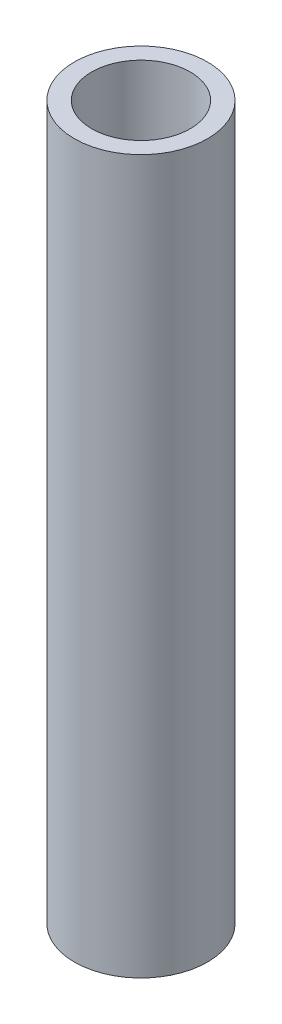
ISO-10303-21;
HEADER;
FILE_DESCRIPTION(('STEP AP214'),'2;1');
FILE_NAME('part.step','',(''),(''),'','','');
FILE_SCHEMA(('AUTOMOTIVE_DESIGN { 1 0 10303 214 1 1 1 1 }'));
ENDSEC;
DATA;
#1=APPLICATION_CONTEXT('core data for automotive mechanical design processes');
#2=APPLICATION_PROTOCOL_DEFINITION('international standard','automotive_design',2000,#1);
#3=PRODUCT_CONTEXT('',#1,'mechanical');
#4=PRODUCT('Part','Part','',(#3));
#5=PRODUCT_RELATED_PRODUCT_CATEGORY('part','',(#4));
#6=PRODUCT_DEFINITION_FORMATION('','',#4);
#7=PRODUCT_DEFINITION_CONTEXT('part definition',#1,'design');
#8=PRODUCT_DEFINITION('design','',#6,#7);
#9=PRODUCT_DEFINITION_SHAPE('','',#8);
#10=(LENGTH_UNIT() NAMED_UNIT(*) SI_UNIT(.MILLI.,.METRE.));
#11=(NAMED_UNIT(*) PLANE_ANGLE_UNIT() SI_UNIT($,.RADIAN.));
#12=(NAMED_UNIT(*) SI_UNIT($,.STERADIAN.) SOLID_ANGLE_UNIT());
#13=UNCERTAINTY_MEASURE_WITH_UNIT(LENGTH_MEASURE(1.E-05),#10,'distance_accuracy_value','');
#14=(GEOMETRIC_REPRESENTATION_CONTEXT(3) GLOBAL_UNCERTAINTY_ASSIGNED_CONTEXT((#13)) GLOBAL_UNIT_ASSIGNED_CONTEXT((#10,
#11,#12)) REPRESENTATION_CONTEXT('',''));
#15=CARTESIAN_POINT('',(0.,0.,0.));
#16=DIRECTION('',(0.,0.,1.));
#17=DIRECTION('',(1.,0.,0.));
#18=AXIS2_PLACEMENT_3D('',#15,#16,#17);
#19=CARTESIAN_POINT('',(0.,114.3,0.));
#20=DIRECTION('',(0.,1.,0.));
#21=DIRECTION('',(0.,0.,1.));
#22=AXIS2_PLACEMENT_3D('',#19,#20,#21);
#23=PLANE('',#22);
#24=CARTESIAN_POINT('',(0.,114.3,0.));
#25=DIRECTION('',(0.,1.,0.));
#26=DIRECTION('',(0.,0.,1.));
#27=AXIS2_PLACEMENT_3D('',#24,#25,#26);
#28=CIRCLE('',#27,10.668);
#29=CARTESIAN_POINT('',(0.,114.3,10.668));
#30=VERTEX_POINT('',#29);
#31=EDGE_CURVE('E10',#30,#30,#28,.T.);
#32=ORIENTED_EDGE('',*,*,#31,.T.);
#33=EDGE_LOOP('',(#32));
#34=FACE_BOUND('',#33,.T.);
#35=CARTESIAN_POINT('',(0.,114.3,0.));
#36=DIRECTION('',(0.,1.,0.));
#37=DIRECTION('',(0.,0.,1.));
#38=AXIS2_PLACEMENT_3D('',#35,#36,#37);
#39=CIRCLE('',#38,7.8994);
#40=CARTESIAN_POINT('',(0.,114.3,7.8994));
#41=VERTEX_POINT('',#40);
#42=EDGE_CURVE('E44',#41,#41,#39,.T.);
#43=ORIENTED_EDGE('',*,*,#42,.F.);
#44=EDGE_LOOP('',(#43));
#45=FACE_BOUND('',#44,.T.);
#46=ADVANCED_FACE('F33',(#34,#45),#23,.T.);
#47=CARTESIAN_POINT('',(0.,0.,0.));
#48=DIRECTION('',(0.,1.,0.));
#49=DIRECTION('',(0.,0.,1.));
#50=AXIS2_PLACEMENT_3D('',#47,#48,#49);
#51=PLANE('',#50);
#52=CARTESIAN_POINT('',(0.,0.,0.));
#53=DIRECTION('',(0.,1.,0.));
#54=DIRECTION('',(0.,0.,1.));
#55=AXIS2_PLACEMENT_3D('',#52,#53,#54);
#56=CIRCLE('',#55,10.668);
#57=CARTESIAN_POINT('',(0.,0.,10.668));
#58=VERTEX_POINT('',#57);
#59=EDGE_CURVE('E37',#58,#58,#56,.T.);
#60=ORIENTED_EDGE('',*,*,#59,.F.);
#61=EDGE_LOOP('',(#60));
#62=FACE_BOUND('',#61,.T.);
#63=CARTESIAN_POINT('',(0.,0.,0.));
#64=DIRECTION('',(0.,1.,0.));
#65=DIRECTION('',(0.,0.,1.));
#66=AXIS2_PLACEMENT_3D('',#63,#64,#65);
#67=CIRCLE('',#66,7.8994);
#68=CARTESIAN_POINT('',(0.,0.,7.8994));
#69=VERTEX_POINT('',#68);
#70=EDGE_CURVE('E46',#69,#69,#67,.T.);
#71=ORIENTED_EDGE('',*,*,#70,.T.);
#72=EDGE_LOOP('',(#71));
#73=FACE_BOUND('',#72,.T.);
#74=ADVANCED_FACE('F56',(#62,#73),#51,.F.);
#75=CARTESIAN_POINT('',(0.,114.3,0.));
#76=DIRECTION('',(0.,-1.,0.));
#77=DIRECTION('',(0.,0.,-1.));
#78=AXIS2_PLACEMENT_3D('',#75,#76,#77);
#79=CYLINDRICAL_SURFACE('',#78,10.668);
#80=ORIENTED_EDGE('',*,*,#31,.F.);
#81=EDGE_LOOP('',(#80));
#82=FACE_BOUND('',#81,.T.);
#83=ORIENTED_EDGE('',*,*,#59,.T.);
#84=EDGE_LOOP('',(#83));
#85=FACE_BOUND('',#84,.T.);
#86=ADVANCED_FACE('F35',(#82,#85),#79,.T.);
#87=CARTESIAN_POINT('',(0.,114.3,0.));
#88=DIRECTION('',(0.,-1.,0.));
#89=DIRECTION('',(0.,0.,-1.));
#90=AXIS2_PLACEMENT_3D('',#87,#88,#89);
#91=CYLINDRICAL_SURFACE('',#90,7.8994);
#92=ORIENTED_EDGE('',*,*,#42,.T.);
#93=EDGE_LOOP('',(#92));
#94=FACE_BOUND('',#93,.T.);
#95=ORIENTED_EDGE('',*,*,#70,.F.);
#96=EDGE_LOOP('',(#95));
#97=FACE_BOUND('',#96,.T.);
#98=ADVANCED_FACE('F52',(#94,#97),#91,.F.);
#99=CLOSED_SHELL('',(#46,#74,#86,#98));
#100=MANIFOLD_SOLID_BREP('B2',#99);
#101=ADVANCED_BREP_SHAPE_REPRESENTATION('',(#18,#100),#14);
#102=SHAPE_DEFINITION_REPRESENTATION(#9,#101);
ENDSEC;
END-ISO-10303-21;
